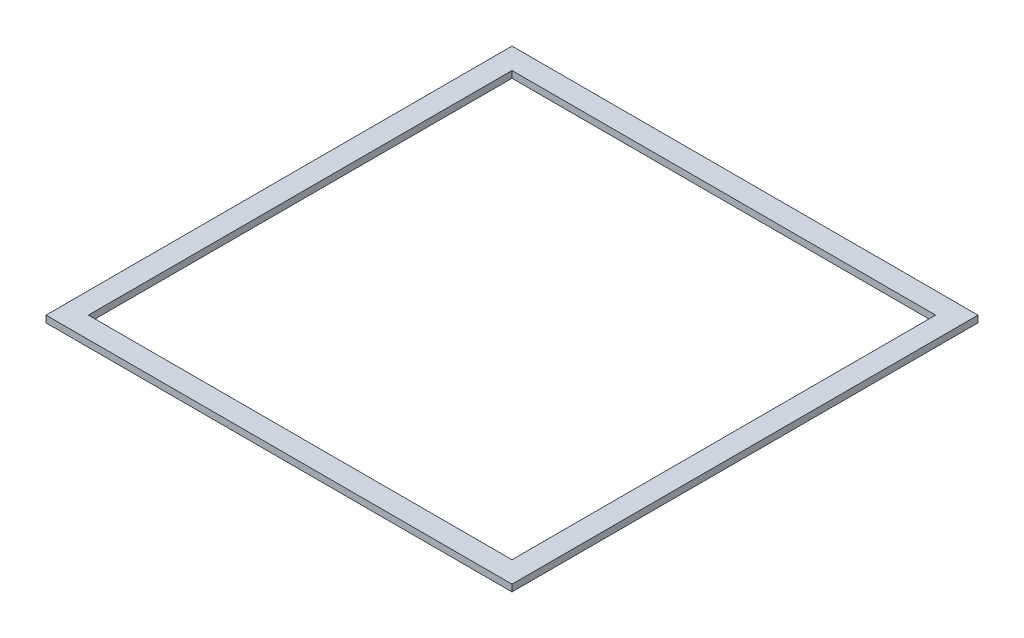
ISO-10303-21;
HEADER;
FILE_DESCRIPTION(('STEP AP214'),'2;1');
FILE_NAME('part.step','',(''),(''),'','','');
FILE_SCHEMA(('AUTOMOTIVE_DESIGN { 1 0 10303 214 1 1 1 1 }'));
ENDSEC;
DATA;
#1=APPLICATION_CONTEXT('core data for automotive mechanical design processes');
#2=APPLICATION_PROTOCOL_DEFINITION('international standard','automotive_design',2000,#1);
#3=PRODUCT_CONTEXT('',#1,'mechanical');
#4=PRODUCT('Part','Part','',(#3));
#5=PRODUCT_RELATED_PRODUCT_CATEGORY('part','',(#4));
#6=PRODUCT_DEFINITION_FORMATION('','',#4);
#7=PRODUCT_DEFINITION_CONTEXT('part definition',#1,'design');
#8=PRODUCT_DEFINITION('design','',#6,#7);
#9=PRODUCT_DEFINITION_SHAPE('','',#8);
#10=(LENGTH_UNIT() NAMED_UNIT(*) SI_UNIT(.MILLI.,.METRE.));
#11=(NAMED_UNIT(*) PLANE_ANGLE_UNIT() SI_UNIT($,.RADIAN.));
#12=(NAMED_UNIT(*) SI_UNIT($,.STERADIAN.) SOLID_ANGLE_UNIT());
#13=UNCERTAINTY_MEASURE_WITH_UNIT(LENGTH_MEASURE(1.E-05),#10,'distance_accuracy_value','');
#14=(GEOMETRIC_REPRESENTATION_CONTEXT(3) GLOBAL_UNCERTAINTY_ASSIGNED_CONTEXT((#13)) GLOBAL_UNIT_ASSIGNED_CONTEXT((#10,
#11,#12)) REPRESENTATION_CONTEXT('',''));
#15=CARTESIAN_POINT('',(0.,0.,0.));
#16=DIRECTION('',(0.,0.,1.));
#17=DIRECTION('',(1.,0.,0.));
#18=AXIS2_PLACEMENT_3D('',#15,#16,#17);
#19=CARTESIAN_POINT('',(0.,0.79375,0.));
#20=DIRECTION('',(0.,1.,0.));
#21=DIRECTION('',(0.,0.,1.));
#22=AXIS2_PLACEMENT_3D('',#19,#20,#21);
#23=PLANE('',#22);
#24=DIRECTION('',(0.,0.,-1.));
#25=VECTOR('',#24,1.);
#26=CARTESIAN_POINT('',(55.,0.79375,-55.));
#27=LINE('',#26,#25);
#28=CARTESIAN_POINT('',(55.,0.79375,55.));
#29=VERTEX_POINT('',#28);
#30=CARTESIAN_POINT('',(55.,0.79375,-55.));
#31=VERTEX_POINT('',#30);
#32=EDGE_CURVE('E133',#29,#31,#27,.T.);
#33=ORIENTED_EDGE('',*,*,#32,.T.);
#34=DIRECTION('',(-1.,0.,0.));
#35=VECTOR('',#34,1.);
#36=CARTESIAN_POINT('',(-55.,0.79375,-55.));
#37=LINE('',#36,#35);
#38=CARTESIAN_POINT('',(-55.,0.79375,-55.));
#39=VERTEX_POINT('',#38);
#40=EDGE_CURVE('E136',#31,#39,#37,.T.);
#41=ORIENTED_EDGE('',*,*,#40,.T.);
#42=DIRECTION('',(0.,0.,1.));
#43=VECTOR('',#42,1.);
#44=CARTESIAN_POINT('',(-55.,0.79375,-55.));
#45=LINE('',#44,#43);
#46=CARTESIAN_POINT('',(-55.,0.79375,55.));
#47=VERTEX_POINT('',#46);
#48=EDGE_CURVE('E139',#39,#47,#45,.T.);
#49=ORIENTED_EDGE('',*,*,#48,.T.);
#50=DIRECTION('',(1.,0.,0.));
#51=VECTOR('',#50,1.);
#52=CARTESIAN_POINT('',(-55.,0.79375,55.));
#53=LINE('',#52,#51);
#54=EDGE_CURVE('E141',#47,#29,#53,.T.);
#55=ORIENTED_EDGE('',*,*,#54,.T.);
#56=EDGE_LOOP('',(#33,#41,#49,#55));
#57=FACE_BOUND('',#56,.T.);
#58=DIRECTION('',(1.,0.,0.));
#59=VECTOR('',#58,1.);
#60=CARTESIAN_POINT('',(-50.,0.79375,50.));
#61=LINE('',#60,#59);
#62=CARTESIAN_POINT('',(-50.,0.79375,50.));
#63=VERTEX_POINT('',#62);
#64=CARTESIAN_POINT('',(50.,0.79375,50.));
#65=VERTEX_POINT('',#64);
#66=EDGE_CURVE('E105',#63,#65,#61,.T.);
#67=ORIENTED_EDGE('',*,*,#66,.F.);
#68=DIRECTION('',(0.,0.,1.));
#69=VECTOR('',#68,1.);
#70=CARTESIAN_POINT('',(-50.,0.79375,-50.));
#71=LINE('',#70,#69);
#72=CARTESIAN_POINT('',(-50.,0.79375,-50.));
#73=VERTEX_POINT('',#72);
#74=EDGE_CURVE('E97',#73,#63,#71,.T.);
#75=ORIENTED_EDGE('',*,*,#74,.F.);
#76=DIRECTION('',(-1.,0.,0.));
#77=VECTOR('',#76,1.);
#78=CARTESIAN_POINT('',(-50.,0.79375,-50.));
#79=LINE('',#78,#77);
#80=CARTESIAN_POINT('',(50.,0.79375,-50.));
#81=VERTEX_POINT('',#80);
#82=EDGE_CURVE('E119',#81,#73,#79,.T.);
#83=ORIENTED_EDGE('',*,*,#82,.F.);
#84=DIRECTION('',(0.,0.,-1.));
#85=VECTOR('',#84,1.);
#86=CARTESIAN_POINT('',(50.,0.79375,-50.));
#87=LINE('',#86,#85);
#88=EDGE_CURVE('E117',#65,#81,#87,.T.);
#89=ORIENTED_EDGE('',*,*,#88,.F.);
#90=EDGE_LOOP('',(#67,#75,#83,#89));
#91=FACE_BOUND('',#90,.T.);
#92=ADVANCED_FACE('F32',(#57,#91),#23,.T.);
#93=CARTESIAN_POINT('',(0.,-0.79375,0.));
#94=DIRECTION('',(0.,1.,0.));
#95=DIRECTION('',(0.,0.,1.));
#96=AXIS2_PLACEMENT_3D('',#93,#94,#95);
#97=PLANE('',#96);
#98=DIRECTION('',(0.,0.,-1.));
#99=VECTOR('',#98,1.);
#100=CARTESIAN_POINT('',(55.,-0.79375,-55.));
#101=LINE('',#100,#99);
#102=CARTESIAN_POINT('',(55.,-0.79375,55.));
#103=VERTEX_POINT('',#102);
#104=CARTESIAN_POINT('',(55.,-0.79375,-55.));
#105=VERTEX_POINT('',#104);
#106=EDGE_CURVE('E113',#103,#105,#101,.T.);
#107=ORIENTED_EDGE('',*,*,#106,.F.);
#108=DIRECTION('',(1.,0.,0.));
#109=VECTOR('',#108,1.);
#110=CARTESIAN_POINT('',(-55.,-0.79375,55.));
#111=LINE('',#110,#109);
#112=CARTESIAN_POINT('',(-55.,-0.79375,55.));
#113=VERTEX_POINT('',#112);
#114=EDGE_CURVE('E137',#113,#103,#111,.T.);
#115=ORIENTED_EDGE('',*,*,#114,.F.);
#116=DIRECTION('',(0.,0.,1.));
#117=VECTOR('',#116,1.);
#118=CARTESIAN_POINT('',(-55.,-0.79375,-55.));
#119=LINE('',#118,#117);
#120=CARTESIAN_POINT('',(-55.,-0.79375,-55.));
#121=VERTEX_POINT('',#120);
#122=EDGE_CURVE('E148',#121,#113,#119,.T.);
#123=ORIENTED_EDGE('',*,*,#122,.F.);
#124=DIRECTION('',(-1.,0.,0.));
#125=VECTOR('',#124,1.);
#126=CARTESIAN_POINT('',(-55.,-0.79375,-55.));
#127=LINE('',#126,#125);
#128=EDGE_CURVE('E146',#105,#121,#127,.T.);
#129=ORIENTED_EDGE('',*,*,#128,.F.);
#130=EDGE_LOOP('',(#107,#115,#123,#129));
#131=FACE_BOUND('',#130,.T.);
#132=DIRECTION('',(0.,0.,1.));
#133=VECTOR('',#132,1.);
#134=CARTESIAN_POINT('',(-50.,-0.79375,-50.));
#135=LINE('',#134,#133);
#136=CARTESIAN_POINT('',(-50.,-0.79375,-50.));
#137=VERTEX_POINT('',#136);
#138=CARTESIAN_POINT('',(-50.,-0.79375,50.));
#139=VERTEX_POINT('',#138);
#140=EDGE_CURVE('E55',#137,#139,#135,.T.);
#141=ORIENTED_EDGE('',*,*,#140,.T.);
#142=DIRECTION('',(1.,0.,0.));
#143=VECTOR('',#142,1.);
#144=CARTESIAN_POINT('',(-50.,-0.79375,50.));
#145=LINE('',#144,#143);
#146=CARTESIAN_POINT('',(50.,-0.79375,50.));
#147=VERTEX_POINT('',#146);
#148=EDGE_CURVE('E112',#139,#147,#145,.T.);
#149=ORIENTED_EDGE('',*,*,#148,.T.);
#150=DIRECTION('',(0.,0.,-1.));
#151=VECTOR('',#150,1.);
#152=CARTESIAN_POINT('',(50.,-0.79375,-50.));
#153=LINE('',#152,#151);
#154=CARTESIAN_POINT('',(50.,-0.79375,-50.));
#155=VERTEX_POINT('',#154);
#156=EDGE_CURVE('E125',#147,#155,#153,.T.);
#157=ORIENTED_EDGE('',*,*,#156,.T.);
#158=DIRECTION('',(-1.,0.,0.));
#159=VECTOR('',#158,1.);
#160=CARTESIAN_POINT('',(-50.,-0.79375,-50.));
#161=LINE('',#160,#159);
#162=EDGE_CURVE('E106',#155,#137,#161,.T.);
#163=ORIENTED_EDGE('',*,*,#162,.T.);
#164=EDGE_LOOP('',(#141,#149,#157,#163));
#165=FACE_BOUND('',#164,.T.);
#166=ADVANCED_FACE('F166',(#131,#165),#97,.F.);
#167=CARTESIAN_POINT('',(55.,0.79375,-55.));
#168=DIRECTION('',(-1.,0.,0.));
#169=DIRECTION('',(0.,0.,1.));
#170=AXIS2_PLACEMENT_3D('',#167,#168,#169);
#171=PLANE('',#170);
#172=ORIENTED_EDGE('',*,*,#106,.T.);
#173=DIRECTION('',(0.,-1.,0.));
#174=VECTOR('',#173,1.);
#175=CARTESIAN_POINT('',(55.,0.79375,-55.));
#176=LINE('',#175,#174);
#177=EDGE_CURVE('E11',#31,#105,#176,.T.);
#178=ORIENTED_EDGE('',*,*,#177,.F.);
#179=ORIENTED_EDGE('',*,*,#32,.F.);
#180=DIRECTION('',(0.,-1.,0.));
#181=VECTOR('',#180,1.);
#182=CARTESIAN_POINT('',(55.,0.79375,55.));
#183=LINE('',#182,#181);
#184=EDGE_CURVE('E143',#29,#103,#183,.T.);
#185=ORIENTED_EDGE('',*,*,#184,.T.);
#186=EDGE_LOOP('',(#172,#178,#179,#185));
#187=FACE_BOUND('',#186,.T.);
#188=ADVANCED_FACE('F34',(#187),#171,.F.);
#189=CARTESIAN_POINT('',(-55.,0.79375,-55.));
#190=DIRECTION('',(0.,0.,1.));
#191=DIRECTION('',(1.,0.,0.));
#192=AXIS2_PLACEMENT_3D('',#189,#190,#191);
#193=PLANE('',#192);
#194=ORIENTED_EDGE('',*,*,#128,.T.);
#195=DIRECTION('',(0.,-1.,0.));
#196=VECTOR('',#195,1.);
#197=CARTESIAN_POINT('',(-55.,0.79375,-55.));
#198=LINE('',#197,#196);
#199=EDGE_CURVE('E40',#39,#121,#198,.T.);
#200=ORIENTED_EDGE('',*,*,#199,.F.);
#201=ORIENTED_EDGE('',*,*,#40,.F.);
#202=ORIENTED_EDGE('',*,*,#177,.T.);
#203=EDGE_LOOP('',(#194,#200,#201,#202));
#204=FACE_BOUND('',#203,.T.);
#205=ADVANCED_FACE('F176',(#204),#193,.F.);
#206=CARTESIAN_POINT('',(-55.,0.79375,-55.));
#207=DIRECTION('',(1.,0.,0.));
#208=DIRECTION('',(0.,0.,-1.));
#209=AXIS2_PLACEMENT_3D('',#206,#207,#208);
#210=PLANE('',#209);
#211=ORIENTED_EDGE('',*,*,#122,.T.);
#212=DIRECTION('',(0.,-1.,0.));
#213=VECTOR('',#212,1.);
#214=CARTESIAN_POINT('',(-55.,0.79375,55.));
#215=LINE('',#214,#213);
#216=EDGE_CURVE('E153',#47,#113,#215,.T.);
#217=ORIENTED_EDGE('',*,*,#216,.F.);
#218=ORIENTED_EDGE('',*,*,#48,.F.);
#219=ORIENTED_EDGE('',*,*,#199,.T.);
#220=EDGE_LOOP('',(#211,#217,#218,#219));
#221=FACE_BOUND('',#220,.T.);
#222=ADVANCED_FACE('F160',(#221),#210,.F.);
#223=CARTESIAN_POINT('',(-55.,0.79375,55.));
#224=DIRECTION('',(0.,0.,-1.));
#225=DIRECTION('',(-1.,0.,0.));
#226=AXIS2_PLACEMENT_3D('',#223,#224,#225);
#227=PLANE('',#226);
#228=ORIENTED_EDGE('',*,*,#114,.T.);
#229=ORIENTED_EDGE('',*,*,#184,.F.);
#230=ORIENTED_EDGE('',*,*,#54,.F.);
#231=ORIENTED_EDGE('',*,*,#216,.T.);
#232=EDGE_LOOP('',(#228,#229,#230,#231));
#233=FACE_BOUND('',#232,.T.);
#234=ADVANCED_FACE('F170',(#233),#227,.F.);
#235=CARTESIAN_POINT('',(-50.,0.79375,-50.));
#236=DIRECTION('',(1.,0.,0.));
#237=DIRECTION('',(0.,0.,-1.));
#238=AXIS2_PLACEMENT_3D('',#235,#236,#237);
#239=PLANE('',#238);
#240=ORIENTED_EDGE('',*,*,#140,.F.);
#241=DIRECTION('',(0.,-1.,0.));
#242=VECTOR('',#241,1.);
#243=CARTESIAN_POINT('',(-50.,0.79375,-50.));
#244=LINE('',#243,#242);
#245=EDGE_CURVE('E101',#73,#137,#244,.T.);
#246=ORIENTED_EDGE('',*,*,#245,.F.);
#247=ORIENTED_EDGE('',*,*,#74,.T.);
#248=DIRECTION('',(0.,-1.,0.));
#249=VECTOR('',#248,1.);
#250=CARTESIAN_POINT('',(-50.,0.79375,50.));
#251=LINE('',#250,#249);
#252=EDGE_CURVE('E100',#63,#139,#251,.T.);
#253=ORIENTED_EDGE('',*,*,#252,.T.);
#254=EDGE_LOOP('',(#240,#246,#247,#253));
#255=FACE_BOUND('',#254,.T.);
#256=ADVANCED_FACE('F99',(#255),#239,.T.);
#257=CARTESIAN_POINT('',(-50.,0.79375,50.));
#258=DIRECTION('',(0.,0.,-1.));
#259=DIRECTION('',(-1.,0.,0.));
#260=AXIS2_PLACEMENT_3D('',#257,#258,#259);
#261=PLANE('',#260);
#262=ORIENTED_EDGE('',*,*,#148,.F.);
#263=ORIENTED_EDGE('',*,*,#252,.F.);
#264=ORIENTED_EDGE('',*,*,#66,.T.);
#265=DIRECTION('',(0.,-1.,0.));
#266=VECTOR('',#265,1.);
#267=CARTESIAN_POINT('',(50.,0.79375,50.));
#268=LINE('',#267,#266);
#269=EDGE_CURVE('E114',#65,#147,#268,.T.);
#270=ORIENTED_EDGE('',*,*,#269,.T.);
#271=EDGE_LOOP('',(#262,#263,#264,#270));
#272=FACE_BOUND('',#271,.T.);
#273=ADVANCED_FACE('F109',(#272),#261,.T.);
#274=CARTESIAN_POINT('',(50.,0.79375,-50.));
#275=DIRECTION('',(-1.,0.,0.));
#276=DIRECTION('',(0.,0.,1.));
#277=AXIS2_PLACEMENT_3D('',#274,#275,#276);
#278=PLANE('',#277);
#279=ORIENTED_EDGE('',*,*,#156,.F.);
#280=ORIENTED_EDGE('',*,*,#269,.F.);
#281=ORIENTED_EDGE('',*,*,#88,.T.);
#282=DIRECTION('',(0.,-1.,0.));
#283=VECTOR('',#282,1.);
#284=CARTESIAN_POINT('',(50.,0.79375,-50.));
#285=LINE('',#284,#283);
#286=EDGE_CURVE('E47',#81,#155,#285,.T.);
#287=ORIENTED_EDGE('',*,*,#286,.T.);
#288=EDGE_LOOP('',(#279,#280,#281,#287));
#289=FACE_BOUND('',#288,.T.);
#290=ADVANCED_FACE('F199',(#289),#278,.T.);
#291=CARTESIAN_POINT('',(-50.,0.79375,-50.));
#292=DIRECTION('',(0.,0.,1.));
#293=DIRECTION('',(1.,0.,0.));
#294=AXIS2_PLACEMENT_3D('',#291,#292,#293);
#295=PLANE('',#294);
#296=ORIENTED_EDGE('',*,*,#162,.F.);
#297=ORIENTED_EDGE('',*,*,#286,.F.);
#298=ORIENTED_EDGE('',*,*,#82,.T.);
#299=ORIENTED_EDGE('',*,*,#245,.T.);
#300=EDGE_LOOP('',(#296,#297,#298,#299));
#301=FACE_BOUND('',#300,.T.);
#302=ADVANCED_FACE('F203',(#301),#295,.T.);
#303=CLOSED_SHELL('',(#92,#166,#188,#205,#222,#234,#256,#273,#290,#302));
#304=MANIFOLD_SOLID_BREP('B2',#303);
#305=ADVANCED_BREP_SHAPE_REPRESENTATION('',(#18,#304),#14);
#306=SHAPE_DEFINITION_REPRESENTATION(#9,#305);
ENDSEC;
END-ISO-10303-21;
